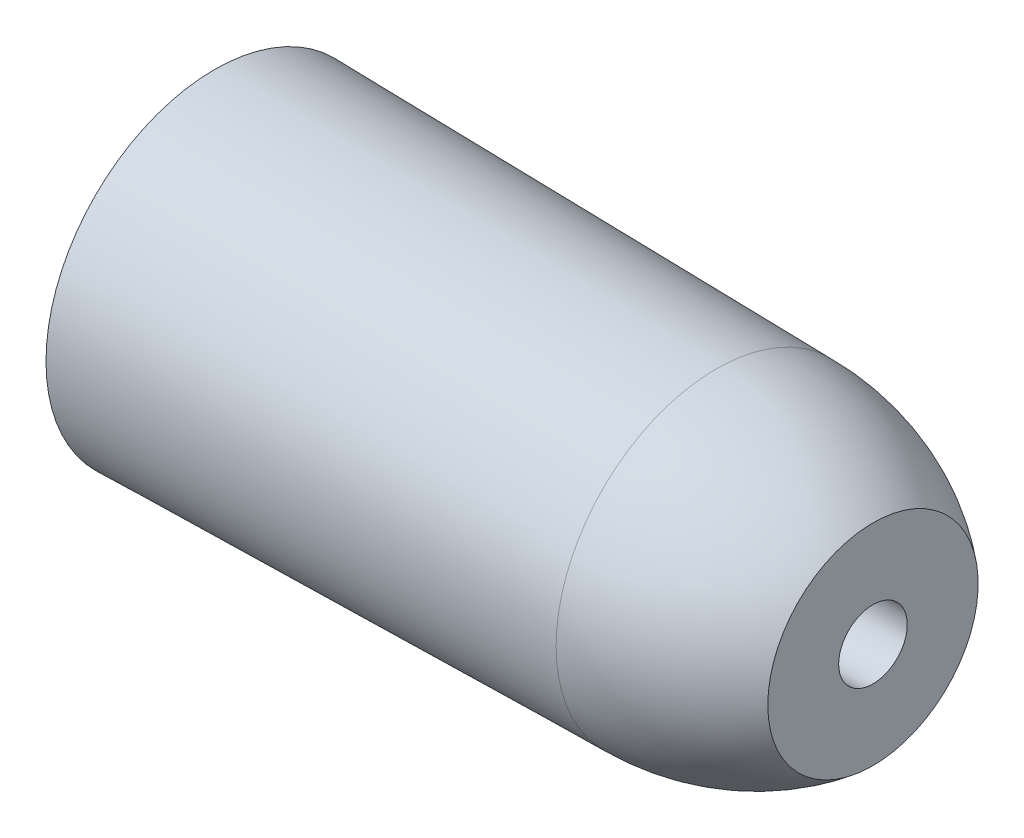
ISO-10303-21;
HEADER;
FILE_DESCRIPTION(('STEP AP214'),'2;1');
FILE_NAME('part.step','',(''),(''),'','','');
FILE_SCHEMA(('AUTOMOTIVE_DESIGN { 1 0 10303 214 1 1 1 1 }'));
ENDSEC;
DATA;
#1=APPLICATION_CONTEXT('core data for automotive mechanical design processes');
#2=APPLICATION_PROTOCOL_DEFINITION('international standard','automotive_design',2000,#1);
#3=PRODUCT_CONTEXT('',#1,'mechanical');
#4=PRODUCT('Part','Part','',(#3));
#5=PRODUCT_RELATED_PRODUCT_CATEGORY('part','',(#4));
#6=PRODUCT_DEFINITION_FORMATION('','',#4);
#7=PRODUCT_DEFINITION_CONTEXT('part definition',#1,'design');
#8=PRODUCT_DEFINITION('design','',#6,#7);
#9=PRODUCT_DEFINITION_SHAPE('','',#8);
#10=(LENGTH_UNIT() NAMED_UNIT(*) SI_UNIT(.MILLI.,.METRE.));
#11=(NAMED_UNIT(*) PLANE_ANGLE_UNIT() SI_UNIT($,.RADIAN.));
#12=(NAMED_UNIT(*) SI_UNIT($,.STERADIAN.) SOLID_ANGLE_UNIT());
#13=UNCERTAINTY_MEASURE_WITH_UNIT(LENGTH_MEASURE(1.E-05),#10,'distance_accuracy_value','');
#14=(GEOMETRIC_REPRESENTATION_CONTEXT(3) GLOBAL_UNCERTAINTY_ASSIGNED_CONTEXT((#13)) GLOBAL_UNIT_ASSIGNED_CONTEXT((#10,
#11,#12)) REPRESENTATION_CONTEXT('',''));
#15=CARTESIAN_POINT('',(0.,0.,0.));
#16=DIRECTION('',(0.,0.,1.));
#17=DIRECTION('',(1.,0.,0.));
#18=AXIS2_PLACEMENT_3D('',#15,#16,#17);
#19=CARTESIAN_POINT('',(-273.05,0.,0.));
#20=DIRECTION('',(-1.,0.,0.));
#21=DIRECTION('',(0.,0.,1.));
#22=AXIS2_PLACEMENT_3D('',#19,#20,#21);
#23=CONICAL_SURFACE('',#22,63.9802871,0.0167076255260351);
#24=CARTESIAN_POINT('',(-82.55,0.,0.));
#25=DIRECTION('',(-1.,0.,0.));
#26=DIRECTION('',(0.,0.,1.));
#27=AXIS2_PLACEMENT_3D('',#24,#25,#26);
#28=CIRCLE('',#27,60.79718825);
#29=CARTESIAN_POINT('',(-82.55,0.,60.79718825));
#30=VERTEX_POINT('',#29);
#31=EDGE_CURVE('E66',#30,#30,#28,.T.);
#32=ORIENTED_EDGE('',*,*,#31,.T.);
#33=EDGE_LOOP('',(#32));
#34=FACE_BOUND('',#33,.T.);
#35=CARTESIAN_POINT('',(-273.05,0.,0.));
#36=DIRECTION('',(-1.,0.,0.));
#37=DIRECTION('',(0.,0.,1.));
#38=AXIS2_PLACEMENT_3D('',#35,#36,#37);
#39=CIRCLE('',#38,63.9802871);
#40=CARTESIAN_POINT('',(-273.05,0.,63.9802871));
#41=VERTEX_POINT('',#40);
#42=EDGE_CURVE('E10',#41,#41,#39,.T.);
#43=ORIENTED_EDGE('',*,*,#42,.F.);
#44=EDGE_LOOP('',(#43));
#45=FACE_BOUND('',#44,.T.);
#46=ADVANCED_FACE('F43',(#34,#45),#23,.T.);
#47=CARTESIAN_POINT('',(-273.05,0.,0.));
#48=DIRECTION('',(-1.,0.,0.));
#49=DIRECTION('',(0.,0.,1.));
#50=AXIS2_PLACEMENT_3D('',#47,#48,#49);
#51=PLANE('',#50);
#52=ORIENTED_EDGE('',*,*,#42,.T.);
#53=EDGE_LOOP('',(#52));
#54=FACE_BOUND('',#53,.T.);
#55=CARTESIAN_POINT('',(-273.05,0.,0.));
#56=DIRECTION('',(-1.,0.,0.));
#57=DIRECTION('',(0.,0.,1.));
#58=AXIS2_PLACEMENT_3D('',#55,#56,#57);
#59=CIRCLE('',#58,12.3);
#60=CARTESIAN_POINT('',(-273.05,0.,12.3));
#61=VERTEX_POINT('',#60);
#62=EDGE_CURVE('E50',#61,#61,#59,.T.);
#63=ORIENTED_EDGE('',*,*,#62,.F.);
#64=EDGE_LOOP('',(#63));
#65=FACE_BOUND('',#64,.T.);
#66=ADVANCED_FACE('F85',(#54,#65),#51,.T.);
#67=CARTESIAN_POINT('',(-273.05,0.,0.));
#68=DIRECTION('',(1.,0.,0.));
#69=DIRECTION('',(0.,0.,-1.));
#70=AXIS2_PLACEMENT_3D('',#67,#68,#69);
#71=CONICAL_SURFACE('',#70,12.3,0.00292985794145398);
#72=CARTESIAN_POINT('',(-23.05,0.,0.));
#73=DIRECTION('',(-1.,0.,0.));
#74=DIRECTION('',(0.,0.,1.));
#75=AXIS2_PLACEMENT_3D('',#72,#73,#74);
#76=CIRCLE('',#75,13.0324665812122);
#77=CARTESIAN_POINT('',(-23.05,0.,13.0324665812122));
#78=VERTEX_POINT('',#77);
#79=EDGE_CURVE('E55',#78,#78,#76,.T.);
#80=ORIENTED_EDGE('',*,*,#79,.F.);
#81=EDGE_LOOP('',(#80));
#82=FACE_BOUND('',#81,.T.);
#83=ORIENTED_EDGE('',*,*,#62,.T.);
#84=EDGE_LOOP('',(#83));
#85=FACE_BOUND('',#84,.T.);
#86=ADVANCED_FACE('F81',(#82,#85),#71,.F.);
#87=CARTESIAN_POINT('',(-23.05,0.,0.));
#88=DIRECTION('',(1.,0.,0.));
#89=DIRECTION('',(0.,0.,-1.));
#90=AXIS2_PLACEMENT_3D('',#87,#88,#89);
#91=PLANE('',#90);
#92=ORIENTED_EDGE('',*,*,#79,.T.);
#93=EDGE_LOOP('',(#92));
#94=FACE_BOUND('',#93,.T.);
#95=CARTESIAN_POINT('',(-23.05,0.,0.));
#96=DIRECTION('',(-1.,0.,0.));
#97=DIRECTION('',(0.,0.,1.));
#98=AXIS2_PLACEMENT_3D('',#95,#96,#97);
#99=CIRCLE('',#98,39.9361417171854);
#100=CARTESIAN_POINT('',(-23.05,0.,39.9361417171854));
#101=VERTEX_POINT('',#100);
#102=EDGE_CURVE('E60',#101,#101,#99,.T.);
#103=ORIENTED_EDGE('',*,*,#102,.F.);
#104=EDGE_LOOP('',(#103));
#105=FACE_BOUND('',#104,.T.);
#106=ADVANCED_FACE('F75',(#94,#105),#91,.T.);
#107=CARTESIAN_POINT('',(-82.55,0.,0.));
#108=DIRECTION('',(-1.,0.,0.));
#109=DIRECTION('',(0.,0.,1.));
#110=AXIS2_PLACEMENT_3D('',#107,#108,#109);
#111=DEGENERATE_TOROIDAL_SURFACE('',#110,34.4864605398838,95.2836487898838,.F.);
#112=ORIENTED_EDGE('',*,*,#102,.T.);
#113=EDGE_LOOP('',(#112));
#114=FACE_BOUND('',#113,.T.);
#115=ORIENTED_EDGE('',*,*,#31,.F.);
#116=EDGE_LOOP('',(#115));
#117=FACE_BOUND('',#116,.T.);
#118=ADVANCED_FACE('F73',(#114,#117),#111,.F.);
#119=CLOSED_SHELL('',(#46,#66,#86,#106,#118));
#120=MANIFOLD_SOLID_BREP('B2',#119);
#121=ADVANCED_BREP_SHAPE_REPRESENTATION('',(#18,#120),#14);
#122=SHAPE_DEFINITION_REPRESENTATION(#9,#121);
ENDSEC;
END-ISO-10303-21;
